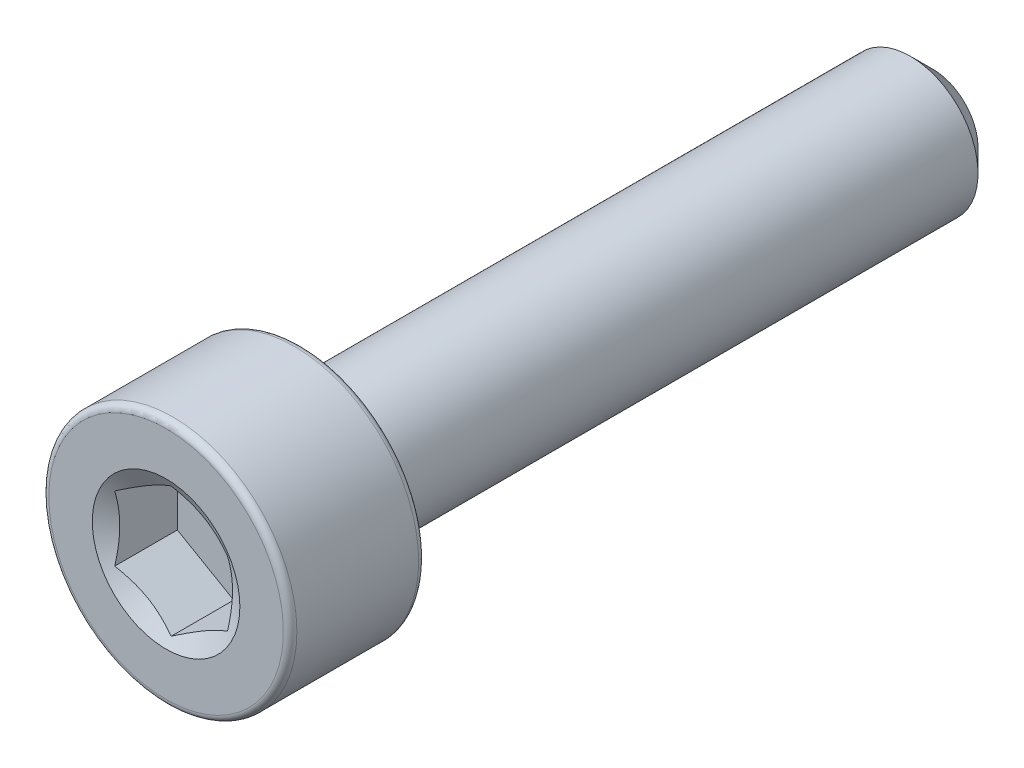
ISO-10303-21;
HEADER;
FILE_DESCRIPTION(('STEP AP214'),'2;1');
FILE_NAME('part.step','',(''),(''),'','','');
FILE_SCHEMA(('AUTOMOTIVE_DESIGN { 1 0 10303 214 1 1 1 1 }'));
ENDSEC;
DATA;
#1=APPLICATION_CONTEXT('core data for automotive mechanical design processes');
#2=APPLICATION_PROTOCOL_DEFINITION('international standard','automotive_design',2000,#1);
#3=PRODUCT_CONTEXT('',#1,'mechanical');
#4=PRODUCT('Part','Part','',(#3));
#5=PRODUCT_RELATED_PRODUCT_CATEGORY('part','',(#4));
#6=PRODUCT_DEFINITION_FORMATION('','',#4);
#7=PRODUCT_DEFINITION_CONTEXT('part definition',#1,'design');
#8=PRODUCT_DEFINITION('design','',#6,#7);
#9=PRODUCT_DEFINITION_SHAPE('','',#8);
#10=(LENGTH_UNIT() NAMED_UNIT(*) SI_UNIT(.MILLI.,.METRE.));
#11=(NAMED_UNIT(*) PLANE_ANGLE_UNIT() SI_UNIT($,.RADIAN.));
#12=(NAMED_UNIT(*) SI_UNIT($,.STERADIAN.) SOLID_ANGLE_UNIT());
#13=UNCERTAINTY_MEASURE_WITH_UNIT(LENGTH_MEASURE(1.E-05),#10,'distance_accuracy_value','');
#14=(GEOMETRIC_REPRESENTATION_CONTEXT(3) GLOBAL_UNCERTAINTY_ASSIGNED_CONTEXT((#13)) GLOBAL_UNIT_ASSIGNED_CONTEXT((#10,
#11,#12)) REPRESENTATION_CONTEXT('',''));
#15=CARTESIAN_POINT('',(0.,0.,0.));
#16=DIRECTION('',(0.,0.,1.));
#17=DIRECTION('',(1.,0.,0.));
#18=AXIS2_PLACEMENT_3D('',#15,#16,#17);
#19=CARTESIAN_POINT('',(0.,0.,-8.5));
#20=DIRECTION('',(0.,0.,-1.));
#21=DIRECTION('',(-1.,0.,0.));
#22=AXIS2_PLACEMENT_3D('',#19,#20,#21);
#23=PLANE('',#22);
#24=CARTESIAN_POINT('',(0.,0.,-8.5));
#25=DIRECTION('',(0.,0.,-1.));
#26=DIRECTION('',(-1.,0.,0.));
#27=AXIS2_PLACEMENT_3D('',#24,#25,#26);
#28=CIRCLE('',#27,1.);
#29=CARTESIAN_POINT('',(-1.,0.,-8.5));
#30=VERTEX_POINT('',#29);
#31=EDGE_CURVE('E61',#30,#30,#28,.T.);
#32=ORIENTED_EDGE('',*,*,#31,.T.);
#33=EDGE_LOOP('',(#32));
#34=FACE_BOUND('',#33,.T.);
#35=ADVANCED_FACE('F47',(#34),#23,.T.);
#36=CARTESIAN_POINT('',(0.,0.,-8.5));
#37=DIRECTION('',(0.,0.,1.));
#38=DIRECTION('',(1.,0.,0.));
#39=AXIS2_PLACEMENT_3D('',#36,#37,#38);
#40=CONICAL_SURFACE('',#39,1.,0.785398163397449);
#41=CARTESIAN_POINT('',(0.,0.,-8.));
#42=DIRECTION('',(0.,0.,-1.));
#43=DIRECTION('',(-1.,0.,0.));
#44=AXIS2_PLACEMENT_3D('',#41,#42,#43);
#45=CIRCLE('',#44,1.50000000000001);
#46=CARTESIAN_POINT('',(-1.50000000000001,0.,-8.));
#47=VERTEX_POINT('',#46);
#48=EDGE_CURVE('E155',#47,#47,#45,.T.);
#49=ORIENTED_EDGE('',*,*,#48,.T.);
#50=EDGE_LOOP('',(#49));
#51=FACE_BOUND('',#50,.T.);
#52=ORIENTED_EDGE('',*,*,#31,.F.);
#53=EDGE_LOOP('',(#52));
#54=FACE_BOUND('',#53,.T.);
#55=ADVANCED_FACE('F163',(#51,#54),#40,.T.);
#56=CARTESIAN_POINT('',(0.,0.,-8.5));
#57=DIRECTION('',(0.,0.,-1.));
#58=DIRECTION('',(-1.,0.,0.));
#59=AXIS2_PLACEMENT_3D('',#56,#57,#58);
#60=CYLINDRICAL_SURFACE('',#59,1.5);
#61=CARTESIAN_POINT('',(0.,0.,5.50000000000001));
#62=DIRECTION('',(0.,0.,-1.));
#63=DIRECTION('',(-1.,0.,0.));
#64=AXIS2_PLACEMENT_3D('',#61,#62,#63);
#65=CIRCLE('',#64,1.5);
#66=CARTESIAN_POINT('',(-1.5,0.,5.50000000000001));
#67=VERTEX_POINT('',#66);
#68=EDGE_CURVE('E151',#67,#67,#65,.T.);
#69=ORIENTED_EDGE('',*,*,#68,.T.);
#70=EDGE_LOOP('',(#69));
#71=FACE_BOUND('',#70,.T.);
#72=ORIENTED_EDGE('',*,*,#48,.F.);
#73=EDGE_LOOP('',(#72));
#74=FACE_BOUND('',#73,.T.);
#75=ADVANCED_FACE('F165',(#71,#74),#60,.T.);
#76=CARTESIAN_POINT('',(0.,1.5,5.5));
#77=DIRECTION('',(0.,0.,-1.));
#78=DIRECTION('',(-1.,0.,0.));
#79=AXIS2_PLACEMENT_3D('',#76,#77,#78);
#80=PLANE('',#79);
#81=CARTESIAN_POINT('',(0.,0.,5.5));
#82=DIRECTION('',(0.,0.,-1.));
#83=DIRECTION('',(-1.,0.,0.));
#84=AXIS2_PLACEMENT_3D('',#81,#82,#83);
#85=CIRCLE('',#84,2.6);
#86=CARTESIAN_POINT('',(-2.6,0.,5.5));
#87=VERTEX_POINT('',#86);
#88=EDGE_CURVE('E147',#87,#87,#85,.T.);
#89=ORIENTED_EDGE('',*,*,#88,.T.);
#90=EDGE_LOOP('',(#89));
#91=FACE_BOUND('',#90,.T.);
#92=ORIENTED_EDGE('',*,*,#68,.F.);
#93=EDGE_LOOP('',(#92));
#94=FACE_BOUND('',#93,.T.);
#95=ADVANCED_FACE('F171',(#91,#94),#80,.T.);
#96=CARTESIAN_POINT('',(0.,0.,5.65));
#97=DIRECTION('',(0.,0.,-1.));
#98=DIRECTION('',(-1.,0.,0.));
#99=AXIS2_PLACEMENT_3D('',#96,#97,#98);
#100=TOROIDAL_SURFACE('',#99,2.6,0.15);
#101=CARTESIAN_POINT('',(0.,0.,5.65));
#102=DIRECTION('',(0.,0.,-1.));
#103=DIRECTION('',(-1.,0.,0.));
#104=AXIS2_PLACEMENT_3D('',#101,#102,#103);
#105=CIRCLE('',#104,2.75);
#106=CARTESIAN_POINT('',(-2.75,0.,5.65));
#107=VERTEX_POINT('',#106);
#108=EDGE_CURVE('E143',#107,#107,#105,.T.);
#109=ORIENTED_EDGE('',*,*,#108,.T.);
#110=EDGE_LOOP('',(#109));
#111=FACE_BOUND('',#110,.T.);
#112=ORIENTED_EDGE('',*,*,#88,.F.);
#113=EDGE_LOOP('',(#112));
#114=FACE_BOUND('',#113,.T.);
#115=ADVANCED_FACE('F177',(#111,#114),#100,.T.);
#116=CARTESIAN_POINT('',(0.,0.,-8.5));
#117=DIRECTION('',(0.,0.,-1.));
#118=DIRECTION('',(-1.,0.,0.));
#119=AXIS2_PLACEMENT_3D('',#116,#117,#118);
#120=CYLINDRICAL_SURFACE('',#119,2.75);
#121=CARTESIAN_POINT('',(0.,0.,8.35));
#122=DIRECTION('',(0.,0.,-1.));
#123=DIRECTION('',(-1.,0.,0.));
#124=AXIS2_PLACEMENT_3D('',#121,#122,#123);
#125=CIRCLE('',#124,2.75);
#126=CARTESIAN_POINT('',(-2.75,0.,8.35));
#127=VERTEX_POINT('',#126);
#128=EDGE_CURVE('E139',#127,#127,#125,.T.);
#129=ORIENTED_EDGE('',*,*,#128,.T.);
#130=EDGE_LOOP('',(#129));
#131=FACE_BOUND('',#130,.T.);
#132=ORIENTED_EDGE('',*,*,#108,.F.);
#133=EDGE_LOOP('',(#132));
#134=FACE_BOUND('',#133,.T.);
#135=ADVANCED_FACE('F181',(#131,#134),#120,.T.);
#136=CARTESIAN_POINT('',(0.,0.,8.35));
#137=DIRECTION('',(0.,0.,-1.));
#138=DIRECTION('',(-1.,0.,0.));
#139=AXIS2_PLACEMENT_3D('',#136,#137,#138);
#140=TOROIDAL_SURFACE('',#139,2.6,0.150000000000001);
#141=CARTESIAN_POINT('',(0.,0.,8.5));
#142=DIRECTION('',(0.,0.,-1.));
#143=DIRECTION('',(-1.,0.,0.));
#144=AXIS2_PLACEMENT_3D('',#141,#142,#143);
#145=CIRCLE('',#144,2.6);
#146=CARTESIAN_POINT('',(-2.6,0.,8.5));
#147=VERTEX_POINT('',#146);
#148=EDGE_CURVE('E135',#147,#147,#145,.T.);
#149=ORIENTED_EDGE('',*,*,#148,.T.);
#150=EDGE_LOOP('',(#149));
#151=FACE_BOUND('',#150,.T.);
#152=ORIENTED_EDGE('',*,*,#128,.F.);
#153=EDGE_LOOP('',(#152));
#154=FACE_BOUND('',#153,.T.);
#155=ADVANCED_FACE('F185',(#151,#154),#140,.T.);
#156=CARTESIAN_POINT('',(0.,2.6,8.5));
#157=DIRECTION('',(0.,0.,1.));
#158=DIRECTION('',(1.,0.,0.));
#159=AXIS2_PLACEMENT_3D('',#156,#157,#158);
#160=PLANE('',#159);
#161=CARTESIAN_POINT('',(0.,0.,8.5));
#162=DIRECTION('',(0.,0.,1.));
#163=DIRECTION('',(1.,0.,0.));
#164=AXIS2_PLACEMENT_3D('',#161,#162,#163);
#165=CIRCLE('',#164,1.63614639414505);
#166=CARTESIAN_POINT('',(1.63614639414505,0.,8.5));
#167=VERTEX_POINT('',#166);
#168=EDGE_CURVE('E293',#167,#167,#165,.T.);
#169=ORIENTED_EDGE('',*,*,#168,.F.);
#170=EDGE_LOOP('',(#169));
#171=FACE_BOUND('',#170,.T.);
#172=ORIENTED_EDGE('',*,*,#148,.F.);
#173=EDGE_LOOP('',(#172));
#174=FACE_BOUND('',#173,.T.);
#175=ADVANCED_FACE('F189',(#171,#174),#160,.T.);
#176=CARTESIAN_POINT('',(0.,0.,8.5));
#177=DIRECTION('',(0.,0.,1.));
#178=DIRECTION('',(1.,0.,0.));
#179=AXIS2_PLACEMENT_3D('',#176,#177,#178);
#180=CONICAL_SURFACE('',#179,1.63614639414505,1.0471975511966);
#181=ORIENTED_EDGE('',*,*,#168,.T.);
#182=EDGE_LOOP('',(#181));
#183=FACE_BOUND('',#182,.T.);
#184=CARTESIAN_POINT('',(1.2502,0.721572366433194,8.38877044690608));
#185=CARTESIAN_POINT('',(1.19526669476823,0.75328812499623,8.37044968700374));
#186=CARTESIAN_POINT('',(1.13985921349976,0.785277649221703,8.35378707844069));
#187=CARTESIAN_POINT('',(1.02808463239966,0.849810733708403,8.32470107618582));
#188=CARTESIAN_POINT('',(0.971715545158287,0.882355441401181,8.3122879742161));
#189=CARTESIAN_POINT('',(0.859676025913013,0.947041487997316,8.29296345987606));
#190=CARTESIAN_POINT('',(0.804022841540768,0.979172868975892,8.28592346168749));
#191=CARTESIAN_POINT('',(0.692454346091606,1.04358696985655,8.27751620487069));
#192=CARTESIAN_POINT('',(0.636539441062398,1.07586945532687,8.27614198744478));
#193=CARTESIAN_POINT('',(0.532042078818273,1.13620103554812,8.27898710960797));
#194=CARTESIAN_POINT('',(0.483444050118683,1.16425912049992,8.28250787106007));
#195=CARTESIAN_POINT('',(0.386564637826761,1.22019247526559,8.29367088493931));
#196=CARTESIAN_POINT('',(0.338283589807836,1.24806755133608,8.30131695781273));
#197=CARTESIAN_POINT('',(0.241204116145956,1.30411641158755,8.32043322694058));
#198=CARTESIAN_POINT('',(0.1924179896481,1.3322830948538,8.33198452921971));
#199=CARTESIAN_POINT('',(0.095573747707898,1.38819614400745,8.35820208693394));
#200=CARTESIAN_POINT('',(0.047514389673036,1.41594322730595,8.37286217437916));
#201=CARTESIAN_POINT('',(-0.000199999999999751,1.4434911430279,8.38877044690608));
#202=B_SPLINE_CURVE_WITH_KNOTS('',3,(#184,#185,#186,#187,#188,#189,#190,#191,#192,#193,#194,
#195,#196,#197,#198,#199,#200,#201),.UNSPECIFIED.,.F.,.F.,(4,2,2,2,2,2,2,2,4),(0.,
0.198150821029559,0.39677819631522,0.590488617354398,0.78396104931718,0.952480056398644,
1.12115539730009,1.29357430343589,1.4656542697693),.UNSPECIFIED.);
#203=CARTESIAN_POINT('',(1.25,0.721687836487032,8.38870377224005));
#204=VERTEX_POINT('',#203);
#205=CARTESIAN_POINT('',(0.,1.44337567297406,8.38870377224005));
#206=VERTEX_POINT('',#205);
#207=EDGE_CURVE('E116',#204,#206,#202,.T.);
#208=ORIENTED_EDGE('',*,*,#207,.F.);
#209=CARTESIAN_POINT('',(1.25,-1.89493751838585,8.86600491612075));
#210=CARTESIAN_POINT('',(1.25,-1.8406706655359,8.83985913696477));
#211=CARTESIAN_POINT('',(1.25,-1.78627450159955,8.81397718008943));
#212=CARTESIAN_POINT('',(1.25,-1.67715428609389,8.7628901449515));
#213=CARTESIAN_POINT('',(1.25,-1.62243018006471,8.73768518315142));
#214=CARTESIAN_POINT('',(1.25,-1.5122815066014,8.68796514956817));
#215=CARTESIAN_POINT('',(1.25,-1.45685471363781,8.66345498656183));
#216=CARTESIAN_POINT('',(1.25,-1.34554530711243,8.61549912463354));
#217=CARTESIAN_POINT('',(1.25,-1.28966271671259,8.59205337201482));
#218=CARTESIAN_POINT('',(1.25,-1.17576624467954,8.5458644070109));
#219=CARTESIAN_POINT('',(1.25,-1.11773662338739,8.52315949733902));
#220=CARTESIAN_POINT('',(1.25,-1.00099484939335,8.4795841161061));
#221=CARTESIAN_POINT('',(1.25,-0.942282613107524,8.45871387193022));
#222=CARTESIAN_POINT('',(1.25,-0.765204349689548,8.39970721918192));
#223=CARTESIAN_POINT('',(1.25,-0.645583882597417,8.36504221898047));
#224=CARTESIAN_POINT('',(1.25,-0.463875702209306,8.32448382828725));
#225=CARTESIAN_POINT('',(1.25,-0.403068506127042,8.31288446104471));
#226=CARTESIAN_POINT('',(1.25,-0.280742753480582,8.29425184547974));
#227=CARTESIAN_POINT('',(1.25,-0.21922425475773,8.28721822850307));
#228=CARTESIAN_POINT('',(1.25,-0.0965698763728659,8.27836802265131));
#229=CARTESIAN_POINT('',(1.25,-0.0354387064128371,8.27648784576509));
#230=CARTESIAN_POINT('',(1.25,0.0867606380824924,8.27793281417568));
#231=CARTESIAN_POINT('',(1.25,0.147828809085717,8.28125823697792));
#232=CARTESIAN_POINT('',(1.25,0.296976974516787,8.29544420543106));
#233=CARTESIAN_POINT('',(1.25,0.384798095172698,8.30902990246888));
#234=CARTESIAN_POINT('',(1.25,0.558777035574827,8.34447190806478));
#235=CARTESIAN_POINT('',(1.25,0.64493277907874,8.36633791854767));
#236=CARTESIAN_POINT('',(1.25,0.77380914518999,8.40387295213096));
#237=CARTESIAN_POINT('',(1.25,0.81719238174285,8.41735279334266));
#238=CARTESIAN_POINT('',(1.25,0.903507427578148,8.44560647226415));
#239=CARTESIAN_POINT('',(1.25,0.946439496790639,8.4603795133102));
#240=CARTESIAN_POINT('',(1.25,1.0319081887352,8.49100070625673));
#241=CARTESIAN_POINT('',(1.25,1.07444487142949,8.50684869200918));
#242=CARTESIAN_POINT('',(1.25,1.1591793213938,8.53944353145431));
#243=CARTESIAN_POINT('',(1.25,1.20137703155215,8.55619053311117));
#244=CARTESIAN_POINT('',(1.25,1.31147066873608,8.6010154405937));
#245=CARTESIAN_POINT('',(1.25,1.37912101228275,8.62969595195012));
#246=CARTESIAN_POINT('',(1.25,1.51378271024307,8.68852402727517));
#247=CARTESIAN_POINT('',(1.25,1.58079400934832,8.71867171687233));
#248=CARTESIAN_POINT('',(1.25,1.78108956687594,8.81078601123408));
#249=CARTESIAN_POINT('',(1.25,1.91360872404133,8.87441259290478));
#250=CARTESIAN_POINT('',(1.25,2.1774904257434,9.00442585055039));
#251=CARTESIAN_POINT('',(1.25,2.30885117753144,9.07081611925632));
#252=CARTESIAN_POINT('',(1.25,2.57065126490253,9.2053391118623));
#253=CARTESIAN_POINT('',(1.25,2.70109073231445,9.2734715797448));
#254=CARTESIAN_POINT('',(1.25,2.94850263370539,9.40414820328686));
#255=CARTESIAN_POINT('',(1.25,3.06553428019949,9.46658065906644));
#256=CARTESIAN_POINT('',(1.25,3.29922001606907,9.59215959614652));
#257=CARTESIAN_POINT('',(1.25,3.41587408902236,9.6553061079814));
#258=CARTESIAN_POINT('',(1.25,3.64856969126785,9.78195631097186));
#259=CARTESIAN_POINT('',(1.25,3.76461202236081,9.84545853098273));
#260=CARTESIAN_POINT('',(1.25,3.99646186521794,9.97287436696805));
#261=CARTESIAN_POINT('',(1.25,4.11226939030719,10.0367879586864));
#262=CARTESIAN_POINT('',(1.25,4.22799321071853,10.1008518334489));
#263=B_SPLINE_CURVE_WITH_KNOTS('',3,(#209,#210,#211,#212,#213,#214,#215,#216,#217,#218,#219,
#220,#221,#222,#223,#224,#225,#226,#227,#228,#229,#230,#231,#232,#233,#234,#235,#236,#237,#238,
#239,#240,#241,#242,#243,#244,#245,#246,#247,#248,#249,#250,#251,#252,#253,#254,#255,#256,#257,
#258,#259,#260,#261,#262),.UNSPECIFIED.,.F.,.F.,(4,2,2,2,2,2,2,2,2,2,2,2,2,2,2,2,2,2,2,2,2,2,2,
2,2,2,4),(0.,0.180713106709462,0.36145710467235,0.543260352902968,0.725054419415467,
0.911961247319592,1.09889120755788,1.47173308257774,1.65730634844025,1.84286462862096,
2.02612278274384,2.20939070651184,2.47544204664139,2.74180608470687,2.87807807877766,
3.0142667067179,3.15043433252001,3.28662443853954,3.50703539668475,3.7274652610487,
4.16841202675703,4.60995110052814,5.05142565849164,5.44935247276722,5.84729636797904,
6.24413951198686,6.64095946708081),.UNSPECIFIED.);
#264=CARTESIAN_POINT('',(1.25,-0.721687836487029,8.38870377224005));
#265=VERTEX_POINT('',#264);
#266=EDGE_CURVE('E235',#265,#204,#263,.T.);
#267=ORIENTED_EDGE('',*,*,#266,.F.);
#268=CARTESIAN_POINT('',(-0.000200000000001156,-1.4434911430279,8.38877044690608));
#269=CARTESIAN_POINT('',(0.0547333052317638,-1.41177538446486,8.37044968700374));
#270=CARTESIAN_POINT('',(0.110140786500238,-1.37978586023939,8.35378707844069));
#271=CARTESIAN_POINT('',(0.221915367600338,-1.31525277575269,8.32470107618582));
#272=CARTESIAN_POINT('',(0.278284454841708,-1.28270806805991,8.3122879742161));
#273=CARTESIAN_POINT('',(0.390323974086982,-1.21802202146378,8.29296345987606));
#274=CARTESIAN_POINT('',(0.445977158459227,-1.1858906404852,8.28592346168748));
#275=CARTESIAN_POINT('',(0.557545653908389,-1.12147653960455,8.27751620487068));
#276=CARTESIAN_POINT('',(0.613460558937597,-1.08919405413422,8.27614198744477));
#277=CARTESIAN_POINT('',(0.717957921181722,-1.02886247391297,8.27898710960797));
#278=CARTESIAN_POINT('',(0.766555949881312,-1.00080438896118,8.28250787106007));
#279=CARTESIAN_POINT('',(0.863435362173235,-0.944871034195501,8.29367088493931));
#280=CARTESIAN_POINT('',(0.91171641019216,-0.916995958125017,8.30131695781273));
#281=CARTESIAN_POINT('',(1.00879588385404,-0.860947097873544,8.32043322694058));
#282=CARTESIAN_POINT('',(1.0575820103519,-0.832780414607287,8.33198452921971));
#283=CARTESIAN_POINT('',(1.1544262522921,-0.776867365453646,8.35820208693394));
#284=CARTESIAN_POINT('',(1.20248561032696,-0.749120282155137,8.37286217437916));
#285=CARTESIAN_POINT('',(1.2502,-0.721572366433191,8.38877044690608));
#286=B_SPLINE_CURVE_WITH_KNOTS('',3,(#268,#269,#270,#271,#272,#273,#274,#275,#276,#277,#278,
#279,#280,#281,#282,#283,#284,#285),.UNSPECIFIED.,.F.,.F.,(4,2,2,2,2,2,2,2,4),(0.,
0.198150821029559,0.39677819631522,0.590488617354398,0.78396104931718,0.952480056398644,
1.1211553973001,1.2935743034359,1.4656542697693),.UNSPECIFIED.);
#287=CARTESIAN_POINT('',(0.,-1.44337567297406,8.38870377224005));
#288=VERTEX_POINT('',#287);
#289=EDGE_CURVE('E229',#288,#265,#286,.T.);
#290=ORIENTED_EDGE('',*,*,#289,.F.);
#291=CARTESIAN_POINT('',(-1.2502,-0.721572366433193,8.38877044690608));
#292=CARTESIAN_POINT('',(-1.19526669476823,-0.753288124996229,8.37044968700374));
#293=CARTESIAN_POINT('',(-1.13985921349976,-0.785277649221702,8.35378707844069));
#294=CARTESIAN_POINT('',(-1.02808463239966,-0.849810733708402,8.32470107618582));
#295=CARTESIAN_POINT('',(-0.971715545158288,-0.882355441401181,8.3122879742161));
#296=CARTESIAN_POINT('',(-0.859676025913014,-0.947041487997316,8.29296345987606));
#297=CARTESIAN_POINT('',(-0.804022841540769,-0.979172868975891,8.28592346168749));
#298=CARTESIAN_POINT('',(-0.692454346091607,-1.04358696985655,8.27751620487069));
#299=CARTESIAN_POINT('',(-0.636539441062398,-1.07586945532687,8.27614198744478));
#300=CARTESIAN_POINT('',(-0.532042078818274,-1.13620103554812,8.27898710960797));
#301=CARTESIAN_POINT('',(-0.483444050118684,-1.16425912049992,8.28250787106007));
#302=CARTESIAN_POINT('',(-0.386564637826761,-1.22019247526559,8.29367088493931));
#303=CARTESIAN_POINT('',(-0.338283589807837,-1.24806755133607,8.30131695781273));
#304=CARTESIAN_POINT('',(-0.241204116145957,-1.30411641158755,8.32043322694058));
#305=CARTESIAN_POINT('',(-0.192417989648101,-1.3322830948538,8.33198452921971));
#306=CARTESIAN_POINT('',(-0.0955737477078986,-1.38819614400745,8.35820208693394));
#307=CARTESIAN_POINT('',(-0.0475143896730366,-1.41594322730595,8.37286217437916));
#308=CARTESIAN_POINT('',(0.000199999999998889,-1.4434911430279,8.38877044690608));
#309=B_SPLINE_CURVE_WITH_KNOTS('',3,(#291,#292,#293,#294,#295,#296,#297,#298,#299,#300,#301,
#302,#303,#304,#305,#306,#307,#308),.UNSPECIFIED.,.F.,.F.,(4,2,2,2,2,2,2,2,4),(0.,
0.198150821029559,0.39677819631522,0.590488617354398,0.78396104931718,0.952480056398644,
1.12115539730009,1.29357430343589,1.4656542697693),.UNSPECIFIED.);
#310=CARTESIAN_POINT('',(-1.25,-0.721687836487031,8.38870377224005));
#311=VERTEX_POINT('',#310);
#312=EDGE_CURVE('E68',#311,#288,#309,.T.);
#313=ORIENTED_EDGE('',*,*,#312,.F.);
#314=CARTESIAN_POINT('',(-1.25,-1.89493751838585,8.86600491612075));
#315=CARTESIAN_POINT('',(-1.25,-1.8406706655359,8.83985913696477));
#316=CARTESIAN_POINT('',(-1.25,-1.78627450159955,8.81397718008943));
#317=CARTESIAN_POINT('',(-1.25,-1.6771542860939,8.7628901449515));
#318=CARTESIAN_POINT('',(-1.25,-1.62243018006471,8.73768518315142));
#319=CARTESIAN_POINT('',(-1.25,-1.51228150660141,8.68796514956817));
#320=CARTESIAN_POINT('',(-1.25,-1.45685471363781,8.66345498656183));
#321=CARTESIAN_POINT('',(-1.25,-1.34554530711243,8.61549912463354));
#322=CARTESIAN_POINT('',(-1.25,-1.28966271671259,8.59205337201483));
#323=CARTESIAN_POINT('',(-1.25,-1.17576624467955,8.5458644070109));
#324=CARTESIAN_POINT('',(-1.25,-1.1177366233874,8.52315949733902));
#325=CARTESIAN_POINT('',(-1.25,-1.00099484939335,8.4795841161061));
#326=CARTESIAN_POINT('',(-1.25,-0.942282613107527,8.45871387193022));
#327=CARTESIAN_POINT('',(-1.25,-0.76520434968955,8.39970721918192));
#328=CARTESIAN_POINT('',(-1.25,-0.645583882597418,8.36504221898047));
#329=CARTESIAN_POINT('',(-1.25,-0.463875702209307,8.32448382828725));
#330=CARTESIAN_POINT('',(-1.25,-0.403068506127044,8.31288446104471));
#331=CARTESIAN_POINT('',(-1.25,-0.280742753480583,8.29425184547974));
#332=CARTESIAN_POINT('',(-1.25,-0.219224254757731,8.28721822850307));
#333=CARTESIAN_POINT('',(-1.25,-0.0965698763728669,8.27836802265131));
#334=CARTESIAN_POINT('',(-1.25,-0.035438706412838,8.27648784576509));
#335=CARTESIAN_POINT('',(-1.25,0.0867606380824915,8.27793281417568));
#336=CARTESIAN_POINT('',(-1.25,0.147828809085716,8.28125823697792));
#337=CARTESIAN_POINT('',(-1.25,0.296976974516785,8.29544420543106));
#338=CARTESIAN_POINT('',(-1.25,0.384798095172697,8.30902990246888));
#339=CARTESIAN_POINT('',(-1.25,0.558777035574825,8.34447190806478));
#340=CARTESIAN_POINT('',(-1.25,0.644932779078739,8.36633791854767));
#341=CARTESIAN_POINT('',(-1.25,0.773809145189988,8.40387295213096));
#342=CARTESIAN_POINT('',(-1.25,0.817192381742848,8.41735279334266));
#343=CARTESIAN_POINT('',(-1.25,0.903507427578145,8.44560647226415));
#344=CARTESIAN_POINT('',(-1.25,0.946439496790637,8.4603795133102));
#345=CARTESIAN_POINT('',(-1.25,1.0319081887352,8.49100070625673));
#346=CARTESIAN_POINT('',(-1.25,1.07444487142949,8.50684869200918));
#347=CARTESIAN_POINT('',(-1.25,1.1591793213938,8.53944353145431));
#348=CARTESIAN_POINT('',(-1.25,1.20137703155215,8.55619053311117));
#349=CARTESIAN_POINT('',(-1.25,1.31147066873608,8.6010154405937));
#350=CARTESIAN_POINT('',(-1.25,1.37912101228275,8.62969595195012));
#351=CARTESIAN_POINT('',(-1.25,1.51378271024307,8.68852402727517));
#352=CARTESIAN_POINT('',(-1.25,1.58079400934831,8.71867171687232));
#353=CARTESIAN_POINT('',(-1.25,1.78108956687593,8.81078601123408));
#354=CARTESIAN_POINT('',(-1.25,1.91360872404133,8.87441259290478));
#355=CARTESIAN_POINT('',(-1.25,2.1774904257434,9.00442585055038));
#356=CARTESIAN_POINT('',(-1.25,2.30885117753144,9.07081611925632));
#357=CARTESIAN_POINT('',(-1.25,2.57065126490253,9.2053391118623));
#358=CARTESIAN_POINT('',(-1.25,2.70109073231445,9.2734715797448));
#359=CARTESIAN_POINT('',(-1.25,2.94850263370539,9.40414820328686));
#360=CARTESIAN_POINT('',(-1.25,3.06553428019949,9.46658065906644));
#361=CARTESIAN_POINT('',(-1.25,3.29922001606907,9.59215959614652));
#362=CARTESIAN_POINT('',(-1.25,3.41587408902236,9.6553061079814));
#363=CARTESIAN_POINT('',(-1.25,3.64856969126785,9.78195631097186));
#364=CARTESIAN_POINT('',(-1.25,3.76461202236081,9.84545853098273));
#365=CARTESIAN_POINT('',(-1.25,3.99646186521794,9.97287436696805));
#366=CARTESIAN_POINT('',(-1.25,4.11226939030719,10.0367879586864));
#367=CARTESIAN_POINT('',(-1.25,4.22799321071853,10.1008518334489));
#368=B_SPLINE_CURVE_WITH_KNOTS('',3,(#314,#315,#316,#317,#318,#319,#320,#321,#322,#323,#324,
#325,#326,#327,#328,#329,#330,#331,#332,#333,#334,#335,#336,#337,#338,#339,#340,#341,#342,#343,
#344,#345,#346,#347,#348,#349,#350,#351,#352,#353,#354,#355,#356,#357,#358,#359,#360,#361,#362,
#363,#364,#365,#366,#367),.UNSPECIFIED.,.F.,.F.,(4,2,2,2,2,2,2,2,2,2,2,2,2,2,2,2,2,2,2,2,2,2,2,
2,2,2,4),(0.,0.180713106709462,0.36145710467235,0.543260352902968,0.725054419415466,
0.91196124731959,1.09889120755788,1.47173308257774,1.65730634844025,1.84286462862096,
2.02612278274384,2.20939070651185,2.47544204664139,2.74180608470687,2.87807807877766,
3.0142667067179,3.15043433252001,3.28662443853954,3.50703539668475,3.7274652610487,
4.16841202675703,4.60995110052814,5.05142565849164,5.44935247276722,5.84729636797904,
6.24413951198686,6.64095946708081),.UNSPECIFIED.);
#369=CARTESIAN_POINT('',(-1.25,0.721687836487031,8.38870377224005));
#370=VERTEX_POINT('',#369);
#371=EDGE_CURVE('E11',#370,#311,#368,.F.);
#372=ORIENTED_EDGE('',*,*,#371,.F.);
#373=CARTESIAN_POINT('',(0.000199999999999941,1.4434911430279,8.38877044690608));
#374=CARTESIAN_POINT('',(-0.0547333052317649,1.41177538446486,8.37044968700374));
#375=CARTESIAN_POINT('',(-0.110140786500239,1.37978586023939,8.35378707844069));
#376=CARTESIAN_POINT('',(-0.221915367600339,1.31525277575269,8.32470107618582));
#377=CARTESIAN_POINT('',(-0.27828445484171,1.28270806805991,8.3122879742161));
#378=CARTESIAN_POINT('',(-0.390323974086984,1.21802202146378,8.29296345987606));
#379=CARTESIAN_POINT('',(-0.445977158459228,1.1858906404852,8.28592346168749));
#380=CARTESIAN_POINT('',(-0.55754565390839,1.12147653960455,8.27751620487069));
#381=CARTESIAN_POINT('',(-0.613460558937599,1.08919405413422,8.27614198744478));
#382=CARTESIAN_POINT('',(-0.717957921181723,1.02886247391297,8.27898710960797));
#383=CARTESIAN_POINT('',(-0.766555949881314,1.00080438896118,8.28250787106007));
#384=CARTESIAN_POINT('',(-0.863435362173236,0.944871034195502,8.29367088493931));
#385=CARTESIAN_POINT('',(-0.911716410192161,0.916995958125018,8.30131695781273));
#386=CARTESIAN_POINT('',(-1.00879588385404,0.860947097873545,8.32043322694058));
#387=CARTESIAN_POINT('',(-1.0575820103519,0.832780414607289,8.33198452921971));
#388=CARTESIAN_POINT('',(-1.1544262522921,0.776867365453647,8.35820208693394));
#389=CARTESIAN_POINT('',(-1.20248561032696,0.749120282155139,8.37286217437916));
#390=CARTESIAN_POINT('',(-1.2502,0.721572366433193,8.38877044690608));
#391=B_SPLINE_CURVE_WITH_KNOTS('',3,(#373,#374,#375,#376,#377,#378,#379,#380,#381,#382,#383,
#384,#385,#386,#387,#388,#389,#390),.UNSPECIFIED.,.F.,.F.,(4,2,2,2,2,2,2,2,4),(0.,
0.198150821029559,0.39677819631522,0.590488617354398,0.78396104931718,0.952480056398644,
1.12115539730009,1.2935743034359,1.4656542697693),.UNSPECIFIED.);
#392=EDGE_CURVE('E106',#206,#370,#391,.T.);
#393=ORIENTED_EDGE('',*,*,#392,.F.);
#394=EDGE_LOOP('',(#208,#267,#290,#313,#372,#393));
#395=FACE_BOUND('',#394,.T.);
#396=ADVANCED_FACE('F105',(#183,#395),#180,.F.);
#397=CARTESIAN_POINT('',(0.,0.,7.));
#398=DIRECTION('',(0.,0.,1.));
#399=DIRECTION('',(1.,0.,0.));
#400=AXIS2_PLACEMENT_3D('',#397,#398,#399);
#401=PLANE('',#400);
#402=DIRECTION('',(-0.866025403784439,-0.5,0.));
#403=VECTOR('',#402,1.);
#404=CARTESIAN_POINT('',(0.,1.44337567297406,7.));
#405=LINE('',#404,#403);
#406=CARTESIAN_POINT('',(0.,1.44337567297406,7.));
#407=VERTEX_POINT('',#406);
#408=CARTESIAN_POINT('',(-1.25,0.721687836487031,7.));
#409=VERTEX_POINT('',#408);
#410=EDGE_CURVE('E115',#407,#409,#405,.T.);
#411=ORIENTED_EDGE('',*,*,#410,.T.);
#412=DIRECTION('',(0.,-1.,0.));
#413=VECTOR('',#412,1.);
#414=CARTESIAN_POINT('',(-1.25,0.721687836487031,7.));
#415=LINE('',#414,#413);
#416=CARTESIAN_POINT('',(-1.25,-0.721687836487031,7.));
#417=VERTEX_POINT('',#416);
#418=EDGE_CURVE('E120',#409,#417,#415,.T.);
#419=ORIENTED_EDGE('',*,*,#418,.T.);
#420=DIRECTION('',(0.866025403784439,-0.5,0.));
#421=VECTOR('',#420,1.);
#422=CARTESIAN_POINT('',(-1.25,-0.721687836487031,7.));
#423=LINE('',#422,#421);
#424=CARTESIAN_POINT('',(0.,-1.44337567297406,7.));
#425=VERTEX_POINT('',#424);
#426=EDGE_CURVE('E262',#417,#425,#423,.T.);
#427=ORIENTED_EDGE('',*,*,#426,.T.);
#428=DIRECTION('',(0.866025403784438,0.5,0.));
#429=VECTOR('',#428,1.);
#430=CARTESIAN_POINT('',(0.,-1.44337567297406,7.));
#431=LINE('',#430,#429);
#432=CARTESIAN_POINT('',(1.25,-0.721687836487029,7.));
#433=VERTEX_POINT('',#432);
#434=EDGE_CURVE('E267',#425,#433,#431,.T.);
#435=ORIENTED_EDGE('',*,*,#434,.T.);
#436=DIRECTION('',(0.,1.,0.));
#437=VECTOR('',#436,1.);
#438=CARTESIAN_POINT('',(1.25,-0.721687836487029,7.));
#439=LINE('',#438,#437);
#440=CARTESIAN_POINT('',(1.25,0.721687836487032,7.));
#441=VERTEX_POINT('',#440);
#442=EDGE_CURVE('E131',#433,#441,#439,.T.);
#443=ORIENTED_EDGE('',*,*,#442,.T.);
#444=DIRECTION('',(-0.866025403784439,0.5,0.));
#445=VECTOR('',#444,1.);
#446=CARTESIAN_POINT('',(1.25,0.721687836487032,7.));
#447=LINE('',#446,#445);
#448=EDGE_CURVE('E124',#441,#407,#447,.T.);
#449=ORIENTED_EDGE('',*,*,#448,.T.);
#450=EDGE_LOOP('',(#411,#419,#427,#435,#443,#449));
#451=FACE_BOUND('',#450,.T.);
#452=ADVANCED_FACE('F215',(#451),#401,.T.);
#453=CARTESIAN_POINT('',(-1.25,0.721687836487031,7.));
#454=DIRECTION('',(-1.,0.,0.));
#455=DIRECTION('',(0.,0.,1.));
#456=AXIS2_PLACEMENT_3D('',#453,#454,#455);
#457=PLANE('',#456);
#458=DIRECTION('',(0.,0.,1.));
#459=VECTOR('',#458,1.);
#460=CARTESIAN_POINT('',(-1.25,0.721687836487031,7.));
#461=LINE('',#460,#459);
#462=EDGE_CURVE('E112',#409,#370,#461,.T.);
#463=ORIENTED_EDGE('',*,*,#462,.T.);
#464=ORIENTED_EDGE('',*,*,#371,.T.);
#465=DIRECTION('',(0.,0.,1.));
#466=VECTOR('',#465,1.);
#467=CARTESIAN_POINT('',(-1.25,-0.721687836487031,7.));
#468=LINE('',#467,#466);
#469=EDGE_CURVE('E123',#417,#311,#468,.T.);
#470=ORIENTED_EDGE('',*,*,#469,.F.);
#471=ORIENTED_EDGE('',*,*,#418,.F.);
#472=EDGE_LOOP('',(#463,#464,#470,#471));
#473=FACE_BOUND('',#472,.T.);
#474=ADVANCED_FACE('F118',(#473),#457,.F.);
#475=CARTESIAN_POINT('',(-1.25,-0.721687836487031,7.));
#476=DIRECTION('',(-0.5,-0.866025403784439,0.));
#477=DIRECTION('',(0.866025403784439,-0.5,0.));
#478=AXIS2_PLACEMENT_3D('',#475,#476,#477);
#479=PLANE('',#478);
#480=ORIENTED_EDGE('',*,*,#469,.T.);
#481=ORIENTED_EDGE('',*,*,#312,.T.);
#482=DIRECTION('',(0.,0.,1.));
#483=VECTOR('',#482,1.);
#484=CARTESIAN_POINT('',(0.,-1.44337567297406,7.));
#485=LINE('',#484,#483);
#486=EDGE_CURVE('E128',#425,#288,#485,.T.);
#487=ORIENTED_EDGE('',*,*,#486,.F.);
#488=ORIENTED_EDGE('',*,*,#426,.F.);
#489=EDGE_LOOP('',(#480,#481,#487,#488));
#490=FACE_BOUND('',#489,.T.);
#491=ADVANCED_FACE('F251',(#490),#479,.F.);
#492=CARTESIAN_POINT('',(0.,-1.44337567297406,7.));
#493=DIRECTION('',(0.5,-0.866025403784438,0.));
#494=DIRECTION('',(0.866025403784438,0.5,0.));
#495=AXIS2_PLACEMENT_3D('',#492,#493,#494);
#496=PLANE('',#495);
#497=ORIENTED_EDGE('',*,*,#486,.T.);
#498=ORIENTED_EDGE('',*,*,#289,.T.);
#499=DIRECTION('',(0.,0.,1.));
#500=VECTOR('',#499,1.);
#501=CARTESIAN_POINT('',(1.25,-0.721687836487029,7.));
#502=LINE('',#501,#500);
#503=EDGE_CURVE('E283',#433,#265,#502,.T.);
#504=ORIENTED_EDGE('',*,*,#503,.F.);
#505=ORIENTED_EDGE('',*,*,#434,.F.);
#506=EDGE_LOOP('',(#497,#498,#504,#505));
#507=FACE_BOUND('',#506,.T.);
#508=ADVANCED_FACE('F246',(#507),#496,.F.);
#509=CARTESIAN_POINT('',(1.25,-0.721687836487029,7.));
#510=DIRECTION('',(1.,0.,0.));
#511=DIRECTION('',(0.,0.,-1.));
#512=AXIS2_PLACEMENT_3D('',#509,#510,#511);
#513=PLANE('',#512);
#514=ORIENTED_EDGE('',*,*,#503,.T.);
#515=ORIENTED_EDGE('',*,*,#266,.T.);
#516=DIRECTION('',(0.,0.,1.));
#517=VECTOR('',#516,1.);
#518=CARTESIAN_POINT('',(1.25,0.721687836487032,7.));
#519=LINE('',#518,#517);
#520=EDGE_CURVE('E279',#441,#204,#519,.T.);
#521=ORIENTED_EDGE('',*,*,#520,.F.);
#522=ORIENTED_EDGE('',*,*,#442,.F.);
#523=EDGE_LOOP('',(#514,#515,#521,#522));
#524=FACE_BOUND('',#523,.T.);
#525=ADVANCED_FACE('F243',(#524),#513,.F.);
#526=CARTESIAN_POINT('',(1.25,0.721687836487032,7.));
#527=DIRECTION('',(0.5,0.866025403784439,0.));
#528=DIRECTION('',(-0.866025403784439,0.5,0.));
#529=AXIS2_PLACEMENT_3D('',#526,#527,#528);
#530=PLANE('',#529);
#531=ORIENTED_EDGE('',*,*,#520,.T.);
#532=ORIENTED_EDGE('',*,*,#207,.T.);
#533=DIRECTION('',(0.,0.,1.));
#534=VECTOR('',#533,1.);
#535=CARTESIAN_POINT('',(0.,1.44337567297406,7.));
#536=LINE('',#535,#534);
#537=EDGE_CURVE('E75',#407,#206,#536,.T.);
#538=ORIENTED_EDGE('',*,*,#537,.F.);
#539=ORIENTED_EDGE('',*,*,#448,.F.);
#540=EDGE_LOOP('',(#531,#532,#538,#539));
#541=FACE_BOUND('',#540,.T.);
#542=ADVANCED_FACE('F196',(#541),#530,.F.);
#543=CARTESIAN_POINT('',(0.,1.44337567297406,7.));
#544=DIRECTION('',(-0.5,0.866025403784439,0.));
#545=DIRECTION('',(-0.866025403784439,-0.5,0.));
#546=AXIS2_PLACEMENT_3D('',#543,#544,#545);
#547=PLANE('',#546);
#548=ORIENTED_EDGE('',*,*,#537,.T.);
#549=ORIENTED_EDGE('',*,*,#392,.T.);
#550=ORIENTED_EDGE('',*,*,#462,.F.);
#551=ORIENTED_EDGE('',*,*,#410,.F.);
#552=EDGE_LOOP('',(#548,#549,#550,#551));
#553=FACE_BOUND('',#552,.T.);
#554=ADVANCED_FACE('F111',(#553),#547,.F.);
#555=CLOSED_SHELL('',(#35,#55,#75,#95,#115,#135,#155,#175,#396,#452,#474,#491,#508,#525,#542,#554));
#556=MANIFOLD_SOLID_BREP('B2',#555);
#557=ADVANCED_BREP_SHAPE_REPRESENTATION('',(#18,#556),#14);
#558=SHAPE_DEFINITION_REPRESENTATION(#9,#557);
ENDSEC;
END-ISO-10303-21;
